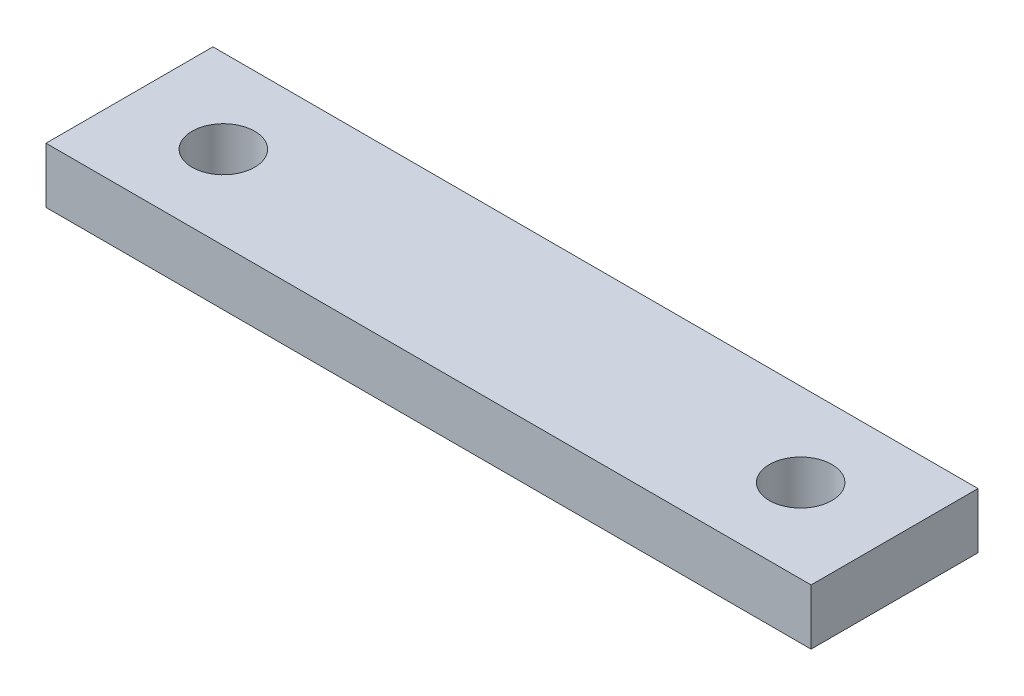
ISO-10303-21;
HEADER;
FILE_DESCRIPTION(('STEP AP214'),'2;1');
FILE_NAME('part.step','',(''),(''),'','','');
FILE_SCHEMA(('AUTOMOTIVE_DESIGN { 1 0 10303 214 1 1 1 1 }'));
ENDSEC;
DATA;
#1=APPLICATION_CONTEXT('core data for automotive mechanical design processes');
#2=APPLICATION_PROTOCOL_DEFINITION('international standard','automotive_design',2000,#1);
#3=PRODUCT_CONTEXT('',#1,'mechanical');
#4=PRODUCT('Part','Part','',(#3));
#5=PRODUCT_RELATED_PRODUCT_CATEGORY('part','',(#4));
#6=PRODUCT_DEFINITION_FORMATION('','',#4);
#7=PRODUCT_DEFINITION_CONTEXT('part definition',#1,'design');
#8=PRODUCT_DEFINITION('design','',#6,#7);
#9=PRODUCT_DEFINITION_SHAPE('','',#8);
#10=(LENGTH_UNIT() NAMED_UNIT(*) SI_UNIT(.MILLI.,.METRE.));
#11=(NAMED_UNIT(*) PLANE_ANGLE_UNIT() SI_UNIT($,.RADIAN.));
#12=(NAMED_UNIT(*) SI_UNIT($,.STERADIAN.) SOLID_ANGLE_UNIT());
#13=UNCERTAINTY_MEASURE_WITH_UNIT(LENGTH_MEASURE(1.E-05),#10,'distance_accuracy_value','');
#14=(GEOMETRIC_REPRESENTATION_CONTEXT(3) GLOBAL_UNCERTAINTY_ASSIGNED_CONTEXT((#13)) GLOBAL_UNIT_ASSIGNED_CONTEXT((#10,
#11,#12)) REPRESENTATION_CONTEXT('',''));
#15=CARTESIAN_POINT('',(0.,0.,0.));
#16=DIRECTION('',(0.,0.,1.));
#17=DIRECTION('',(1.,0.,0.));
#18=AXIS2_PLACEMENT_3D('',#15,#16,#17);
#19=CARTESIAN_POINT('',(0.,4.,0.));
#20=DIRECTION('',(0.,1.,0.));
#21=DIRECTION('',(0.,0.,1.));
#22=AXIS2_PLACEMENT_3D('',#19,#20,#21);
#23=PLANE('',#22);
#24=CARTESIAN_POINT('',(-20.75,4.,0.));
#25=DIRECTION('',(0.,1.,0.));
#26=DIRECTION('',(0.,0.,1.));
#27=AXIS2_PLACEMENT_3D('',#24,#25,#26);
#28=CIRCLE('',#27,2.25);
#29=CARTESIAN_POINT('',(-20.75,4.,2.25));
#30=VERTEX_POINT('',#29);
#31=EDGE_CURVE('E104',#30,#30,#28,.T.);
#32=ORIENTED_EDGE('',*,*,#31,.F.);
#33=EDGE_LOOP('',(#32));
#34=FACE_BOUND('',#33,.T.);
#35=DIRECTION('',(0.,0.,1.));
#36=VECTOR('',#35,1.);
#37=CARTESIAN_POINT('',(-27.5,4.,6.00000000000001));
#38=LINE('',#37,#36);
#39=CARTESIAN_POINT('',(-27.5,4.,-5.99999999999999));
#40=VERTEX_POINT('',#39);
#41=CARTESIAN_POINT('',(-27.5,4.,6.00000000000001));
#42=VERTEX_POINT('',#41);
#43=EDGE_CURVE('E89',#40,#42,#38,.T.);
#44=ORIENTED_EDGE('',*,*,#43,.T.);
#45=DIRECTION('',(1.,0.,0.));
#46=VECTOR('',#45,1.);
#47=CARTESIAN_POINT('',(27.5,4.,6.));
#48=LINE('',#47,#46);
#49=CARTESIAN_POINT('',(27.5,4.,6.));
#50=VERTEX_POINT('',#49);
#51=EDGE_CURVE('E84',#42,#50,#48,.T.);
#52=ORIENTED_EDGE('',*,*,#51,.T.);
#53=DIRECTION('',(0.,0.,-1.));
#54=VECTOR('',#53,1.);
#55=CARTESIAN_POINT('',(27.5,4.,6.));
#56=LINE('',#55,#54);
#57=CARTESIAN_POINT('',(27.5,4.,-6.00000000000002));
#58=VERTEX_POINT('',#57);
#59=EDGE_CURVE('E87',#50,#58,#56,.T.);
#60=ORIENTED_EDGE('',*,*,#59,.T.);
#61=DIRECTION('',(-1.,0.,0.));
#62=VECTOR('',#61,1.);
#63=CARTESIAN_POINT('',(27.5,4.,-6.00000000000002));
#64=LINE('',#63,#62);
#65=EDGE_CURVE('E54',#58,#40,#64,.T.);
#66=ORIENTED_EDGE('',*,*,#65,.T.);
#67=EDGE_LOOP('',(#44,#52,#60,#66));
#68=FACE_BOUND('',#67,.T.);
#69=CARTESIAN_POINT('',(20.75,4.,0.));
#70=DIRECTION('',(0.,1.,0.));
#71=DIRECTION('',(0.,0.,-1.));
#72=AXIS2_PLACEMENT_3D('',#69,#70,#71);
#73=CIRCLE('',#72,2.25);
#74=CARTESIAN_POINT('',(20.75,4.,-2.25));
#75=VERTEX_POINT('',#74);
#76=EDGE_CURVE('E119',#75,#75,#73,.T.);
#77=ORIENTED_EDGE('',*,*,#76,.F.);
#78=EDGE_LOOP('',(#77));
#79=FACE_BOUND('',#78,.T.);
#80=ADVANCED_FACE('F37',(#34,#68,#79),#23,.T.);
#81=CARTESIAN_POINT('',(0.,0.,0.));
#82=DIRECTION('',(0.,1.,0.));
#83=DIRECTION('',(0.,0.,1.));
#84=AXIS2_PLACEMENT_3D('',#81,#82,#83);
#85=PLANE('',#84);
#86=DIRECTION('',(0.,0.,1.));
#87=VECTOR('',#86,1.);
#88=CARTESIAN_POINT('',(-27.5,0.,6.00000000000001));
#89=LINE('',#88,#87);
#90=CARTESIAN_POINT('',(-27.5,0.,-5.99999999999999));
#91=VERTEX_POINT('',#90);
#92=CARTESIAN_POINT('',(-27.5,0.,6.00000000000001));
#93=VERTEX_POINT('',#92);
#94=EDGE_CURVE('E101',#91,#93,#89,.T.);
#95=ORIENTED_EDGE('',*,*,#94,.F.);
#96=DIRECTION('',(-1.,0.,0.));
#97=VECTOR('',#96,1.);
#98=CARTESIAN_POINT('',(27.5,0.,-6.00000000000002));
#99=LINE('',#98,#97);
#100=CARTESIAN_POINT('',(27.5,0.,-6.00000000000002));
#101=VERTEX_POINT('',#100);
#102=EDGE_CURVE('E77',#101,#91,#99,.T.);
#103=ORIENTED_EDGE('',*,*,#102,.F.);
#104=DIRECTION('',(0.,0.,-1.));
#105=VECTOR('',#104,1.);
#106=CARTESIAN_POINT('',(27.5,0.,6.));
#107=LINE('',#106,#105);
#108=CARTESIAN_POINT('',(27.5,0.,6.));
#109=VERTEX_POINT('',#108);
#110=EDGE_CURVE('E71',#109,#101,#107,.T.);
#111=ORIENTED_EDGE('',*,*,#110,.F.);
#112=DIRECTION('',(1.,0.,0.));
#113=VECTOR('',#112,1.);
#114=CARTESIAN_POINT('',(27.5,0.,6.));
#115=LINE('',#114,#113);
#116=EDGE_CURVE('E93',#93,#109,#115,.T.);
#117=ORIENTED_EDGE('',*,*,#116,.F.);
#118=EDGE_LOOP('',(#95,#103,#111,#117));
#119=FACE_BOUND('',#118,.T.);
#120=CARTESIAN_POINT('',(-20.75,0.,0.));
#121=DIRECTION('',(0.,1.,0.));
#122=DIRECTION('',(0.,0.,1.));
#123=AXIS2_PLACEMENT_3D('',#120,#121,#122);
#124=CIRCLE('',#123,2.25);
#125=CARTESIAN_POINT('',(-20.75,0.,2.25));
#126=VERTEX_POINT('',#125);
#127=EDGE_CURVE('E116',#126,#126,#124,.T.);
#128=ORIENTED_EDGE('',*,*,#127,.T.);
#129=EDGE_LOOP('',(#128));
#130=FACE_BOUND('',#129,.T.);
#131=CARTESIAN_POINT('',(20.75,0.,0.));
#132=DIRECTION('',(0.,1.,0.));
#133=DIRECTION('',(0.,0.,-1.));
#134=AXIS2_PLACEMENT_3D('',#131,#132,#133);
#135=CIRCLE('',#134,2.25);
#136=CARTESIAN_POINT('',(20.75,0.,-2.25));
#137=VERTEX_POINT('',#136);
#138=EDGE_CURVE('E122',#137,#137,#135,.T.);
#139=ORIENTED_EDGE('',*,*,#138,.T.);
#140=EDGE_LOOP('',(#139));
#141=FACE_BOUND('',#140,.T.);
#142=ADVANCED_FACE('F112',(#119,#130,#141),#85,.F.);
#143=CARTESIAN_POINT('',(-27.5,4.,6.00000000000001));
#144=DIRECTION('',(1.,0.,0.));
#145=DIRECTION('',(0.,0.,-1.));
#146=AXIS2_PLACEMENT_3D('',#143,#144,#145);
#147=PLANE('',#146);
#148=ORIENTED_EDGE('',*,*,#94,.T.);
#149=DIRECTION('',(0.,-1.,0.));
#150=VECTOR('',#149,1.);
#151=CARTESIAN_POINT('',(-27.5,4.,6.00000000000001));
#152=LINE('',#151,#150);
#153=EDGE_CURVE('E11',#42,#93,#152,.T.);
#154=ORIENTED_EDGE('',*,*,#153,.F.);
#155=ORIENTED_EDGE('',*,*,#43,.F.);
#156=DIRECTION('',(0.,-1.,0.));
#157=VECTOR('',#156,1.);
#158=CARTESIAN_POINT('',(-27.5,4.,-5.99999999999999));
#159=LINE('',#158,#157);
#160=EDGE_CURVE('E97',#40,#91,#159,.T.);
#161=ORIENTED_EDGE('',*,*,#160,.T.);
#162=EDGE_LOOP('',(#148,#154,#155,#161));
#163=FACE_BOUND('',#162,.T.);
#164=ADVANCED_FACE('F39',(#163),#147,.F.);
#165=CARTESIAN_POINT('',(27.5,4.,6.));
#166=DIRECTION('',(0.,0.,-1.));
#167=DIRECTION('',(-1.,0.,0.));
#168=AXIS2_PLACEMENT_3D('',#165,#166,#167);
#169=PLANE('',#168);
#170=ORIENTED_EDGE('',*,*,#116,.T.);
#171=DIRECTION('',(0.,-1.,0.));
#172=VECTOR('',#171,1.);
#173=CARTESIAN_POINT('',(27.5,4.,6.));
#174=LINE('',#173,#172);
#175=EDGE_CURVE('E46',#50,#109,#174,.T.);
#176=ORIENTED_EDGE('',*,*,#175,.F.);
#177=ORIENTED_EDGE('',*,*,#51,.F.);
#178=ORIENTED_EDGE('',*,*,#153,.T.);
#179=EDGE_LOOP('',(#170,#176,#177,#178));
#180=FACE_BOUND('',#179,.T.);
#181=ADVANCED_FACE('F92',(#180),#169,.F.);
#182=CARTESIAN_POINT('',(27.5,4.,6.));
#183=DIRECTION('',(-1.,0.,0.));
#184=DIRECTION('',(0.,0.,1.));
#185=AXIS2_PLACEMENT_3D('',#182,#183,#184);
#186=PLANE('',#185);
#187=ORIENTED_EDGE('',*,*,#110,.T.);
#188=DIRECTION('',(0.,-1.,0.));
#189=VECTOR('',#188,1.);
#190=CARTESIAN_POINT('',(27.5,4.,-6.00000000000002));
#191=LINE('',#190,#189);
#192=EDGE_CURVE('E94',#58,#101,#191,.T.);
#193=ORIENTED_EDGE('',*,*,#192,.F.);
#194=ORIENTED_EDGE('',*,*,#59,.F.);
#195=ORIENTED_EDGE('',*,*,#175,.T.);
#196=EDGE_LOOP('',(#187,#193,#194,#195));
#197=FACE_BOUND('',#196,.T.);
#198=ADVANCED_FACE('F95',(#197),#186,.F.);
#199=CARTESIAN_POINT('',(27.5,4.,-6.00000000000002));
#200=DIRECTION('',(0.,0.,1.));
#201=DIRECTION('',(1.,0.,0.));
#202=AXIS2_PLACEMENT_3D('',#199,#200,#201);
#203=PLANE('',#202);
#204=ORIENTED_EDGE('',*,*,#102,.T.);
#205=ORIENTED_EDGE('',*,*,#160,.F.);
#206=ORIENTED_EDGE('',*,*,#65,.F.);
#207=ORIENTED_EDGE('',*,*,#192,.T.);
#208=EDGE_LOOP('',(#204,#205,#206,#207));
#209=FACE_BOUND('',#208,.T.);
#210=ADVANCED_FACE('F109',(#209),#203,.F.);
#211=CARTESIAN_POINT('',(-20.75,4.,0.));
#212=DIRECTION('',(0.,-1.,0.));
#213=DIRECTION('',(0.,0.,-1.));
#214=AXIS2_PLACEMENT_3D('',#211,#212,#213);
#215=CYLINDRICAL_SURFACE('',#214,2.25);
#216=ORIENTED_EDGE('',*,*,#31,.T.);
#217=EDGE_LOOP('',(#216));
#218=FACE_BOUND('',#217,.T.);
#219=ORIENTED_EDGE('',*,*,#127,.F.);
#220=EDGE_LOOP('',(#219));
#221=FACE_BOUND('',#220,.T.);
#222=ADVANCED_FACE('F139',(#218,#221),#215,.F.);
#223=CARTESIAN_POINT('',(20.75,4.,0.));
#224=DIRECTION('',(0.,-1.,0.));
#225=DIRECTION('',(0.,0.,-1.));
#226=AXIS2_PLACEMENT_3D('',#223,#224,#225);
#227=CYLINDRICAL_SURFACE('',#226,2.25);
#228=ORIENTED_EDGE('',*,*,#76,.T.);
#229=EDGE_LOOP('',(#228));
#230=FACE_BOUND('',#229,.T.);
#231=ORIENTED_EDGE('',*,*,#138,.F.);
#232=EDGE_LOOP('',(#231));
#233=FACE_BOUND('',#232,.T.);
#234=ADVANCED_FACE('F128',(#230,#233),#227,.F.);
#235=CLOSED_SHELL('',(#80,#142,#164,#181,#198,#210,#222,#234));
#236=MANIFOLD_SOLID_BREP('B2',#235);
#237=ADVANCED_BREP_SHAPE_REPRESENTATION('',(#18,#236),#14);
#238=SHAPE_DEFINITION_REPRESENTATION(#9,#237);
ENDSEC;
END-ISO-10303-21;
